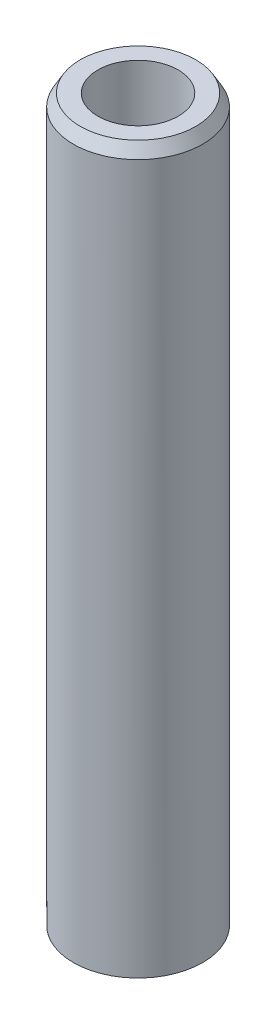
ISO-10303-21;
HEADER;
FILE_DESCRIPTION(('STEP AP214'),'2;1');
FILE_NAME('part.step','',(''),(''),'','','');
FILE_SCHEMA(('AUTOMOTIVE_DESIGN { 1 0 10303 214 1 1 1 1 }'));
ENDSEC;
DATA;
#1=APPLICATION_CONTEXT('core data for automotive mechanical design processes');
#2=APPLICATION_PROTOCOL_DEFINITION('international standard','automotive_design',2000,#1);
#3=PRODUCT_CONTEXT('',#1,'mechanical');
#4=PRODUCT('Part','Part','',(#3));
#5=PRODUCT_RELATED_PRODUCT_CATEGORY('part','',(#4));
#6=PRODUCT_DEFINITION_FORMATION('','',#4);
#7=PRODUCT_DEFINITION_CONTEXT('part definition',#1,'design');
#8=PRODUCT_DEFINITION('design','',#6,#7);
#9=PRODUCT_DEFINITION_SHAPE('','',#8);
#10=(LENGTH_UNIT() NAMED_UNIT(*) SI_UNIT(.MILLI.,.METRE.));
#11=(NAMED_UNIT(*) PLANE_ANGLE_UNIT() SI_UNIT($,.RADIAN.));
#12=(NAMED_UNIT(*) SI_UNIT($,.STERADIAN.) SOLID_ANGLE_UNIT());
#13=UNCERTAINTY_MEASURE_WITH_UNIT(LENGTH_MEASURE(1.E-05),#10,'distance_accuracy_value','');
#14=(GEOMETRIC_REPRESENTATION_CONTEXT(3) GLOBAL_UNCERTAINTY_ASSIGNED_CONTEXT((#13)) GLOBAL_UNIT_ASSIGNED_CONTEXT((#10,
#11,#12)) REPRESENTATION_CONTEXT('',''));
#15=CARTESIAN_POINT('',(0.,0.,0.));
#16=DIRECTION('',(0.,0.,1.));
#17=DIRECTION('',(1.,0.,0.));
#18=AXIS2_PLACEMENT_3D('',#15,#16,#17);
#19=CARTESIAN_POINT('',(0.,281.291442130686,0.));
#20=DIRECTION('',(0.,-1.,0.));
#21=DIRECTION('',(0.,0.,-1.));
#22=AXIS2_PLACEMENT_3D('',#19,#20,#21);
#23=CYLINDRICAL_SURFACE('',#22,25.);
#24=CARTESIAN_POINT('',(0.,276.663477284076,0.));
#25=DIRECTION('',(0.,1.,0.));
#26=DIRECTION('',(0.,0.,1.));
#27=AXIS2_PLACEMENT_3D('',#24,#25,#26);
#28=CIRCLE('',#27,25.);
#29=CARTESIAN_POINT('',(0.,276.663477284076,-25.));
#30=VERTEX_POINT('',#29);
#31=EDGE_CURVE('E50',#30,#30,#28,.F.);
#32=CARTESIAN_POINT('',(0.,2.67195674999049,0.));
#33=DIRECTION('',(0.,1.,0.));
#34=DIRECTION('',(0.,0.,1.));
#35=AXIS2_PLACEMENT_3D('',#32,#33,#34);
#36=CIRCLE('',#35,25.);
#37=CARTESIAN_POINT('',(0.,2.67195674999049,-25.));
#38=VERTEX_POINT('',#37);
#39=EDGE_CURVE('E51',#38,#38,#36,.T.);
#40=CARTESIAN_POINT('',(0.,276.663477284076,-25.));
#41=CARTESIAN_POINT('',(0.,273.809398945179,-25.));
#42=CARTESIAN_POINT('',(0.,270.955320606282,-25.));
#43=CARTESIAN_POINT('',(0.,265.247163928489,-25.));
#44=CARTESIAN_POINT('',(0.,262.393085589592,-25.));
#45=CARTESIAN_POINT('',(0.,256.684928911799,-25.));
#46=CARTESIAN_POINT('',(0.,253.830850572902,-25.));
#47=CARTESIAN_POINT('',(0.,248.122693895109,-25.));
#48=CARTESIAN_POINT('',(0.,245.268615556212,-25.));
#49=CARTESIAN_POINT('',(0.,239.560458878418,-25.));
#50=CARTESIAN_POINT('',(0.,236.706380539522,-25.));
#51=CARTESIAN_POINT('',(0.,230.998223861728,-25.));
#52=CARTESIAN_POINT('',(0.,228.144145522832,-25.));
#53=CARTESIAN_POINT('',(0.,222.435988845038,-25.));
#54=CARTESIAN_POINT('',(0.,219.581910506141,-25.));
#55=CARTESIAN_POINT('',(0.,213.873753828348,-25.));
#56=CARTESIAN_POINT('',(0.,211.019675489451,-25.));
#57=CARTESIAN_POINT('',(0.,205.311518811658,-25.));
#58=CARTESIAN_POINT('',(0.,202.457440472761,-25.));
#59=CARTESIAN_POINT('',(0.,196.749283794968,-25.));
#60=CARTESIAN_POINT('',(0.,193.895205456071,-25.));
#61=CARTESIAN_POINT('',(0.,188.187048778277,-25.));
#62=CARTESIAN_POINT('',(0.,185.332970439381,-25.));
#63=CARTESIAN_POINT('',(0.,179.624813761587,-25.));
#64=CARTESIAN_POINT('',(0.,176.770735422691,-25.));
#65=CARTESIAN_POINT('',(0.,171.062578744897,-25.));
#66=CARTESIAN_POINT('',(0.,168.208500406,-25.));
#67=CARTESIAN_POINT('',(0.,162.500343728207,-25.));
#68=CARTESIAN_POINT('',(0.,159.64626538931,-25.));
#69=CARTESIAN_POINT('',(0.,153.938108711517,-25.));
#70=CARTESIAN_POINT('',(0.,151.08403037262,-25.));
#71=CARTESIAN_POINT('',(0.,145.375873694827,-25.));
#72=CARTESIAN_POINT('',(0.,142.52179535593,-25.));
#73=CARTESIAN_POINT('',(0.,136.813638678136,-25.));
#74=CARTESIAN_POINT('',(0.,133.95956033924,-25.));
#75=CARTESIAN_POINT('',(0.,128.251403661446,-25.));
#76=CARTESIAN_POINT('',(0.,125.39732532255,-25.));
#77=CARTESIAN_POINT('',(0.,119.689168644756,-25.));
#78=CARTESIAN_POINT('',(0.,116.835090305859,-25.));
#79=CARTESIAN_POINT('',(0.,111.126933628066,-25.));
#80=CARTESIAN_POINT('',(0.,108.272855289169,-25.));
#81=CARTESIAN_POINT('',(0.,102.564698611376,-25.));
#82=CARTESIAN_POINT('',(0.,99.7106202724791,-25.));
#83=CARTESIAN_POINT('',(0.,94.0024635946856,-25.));
#84=CARTESIAN_POINT('',(0.,91.1483852557889,-25.));
#85=CARTESIAN_POINT('',(0.,85.4402285779955,-25.));
#86=CARTESIAN_POINT('',(0.,82.5861502390987,-25.));
#87=CARTESIAN_POINT('',(0.,76.8779935613053,-25.));
#88=CARTESIAN_POINT('',(0.,74.0239152224086,-25.));
#89=CARTESIAN_POINT('',(0.,68.3157585446151,-25.));
#90=CARTESIAN_POINT('',(0.,65.4616802057184,-25.));
#91=CARTESIAN_POINT('',(0.,59.753523527925,-25.));
#92=CARTESIAN_POINT('',(0.,56.8994451890282,-25.));
#93=CARTESIAN_POINT('',(0.,51.1912885112348,-25.));
#94=CARTESIAN_POINT('',(0.,48.3372101723381,-25.));
#95=CARTESIAN_POINT('',(0.,42.6290534945446,-25.));
#96=CARTESIAN_POINT('',(0.,39.7749751556479,-25.));
#97=CARTESIAN_POINT('',(0.,34.0668184778545,-25.));
#98=CARTESIAN_POINT('',(0.,31.2127401389577,-25.));
#99=CARTESIAN_POINT('',(0.,25.5045834611643,-25.));
#100=CARTESIAN_POINT('',(0.,22.6505051222676,-25.));
#101=CARTESIAN_POINT('',(0.,16.9423484444741,-25.));
#102=CARTESIAN_POINT('',(0.,14.0882701055774,-25.));
#103=CARTESIAN_POINT('',(0.,8.38011342778394,-25.));
#104=CARTESIAN_POINT('',(0.,5.52603508888722,-25.));
#105=CARTESIAN_POINT('',(0.,2.67195674999049,-25.));
#106=B_SPLINE_CURVE_WITH_KNOTS('',3,(#40,#41,#42,#43,#44,#45,#46,#47,#48,#49,#50,#51,#52,#53,
#54,#55,#56,#57,#58,#59,#60,#61,#62,#63,#64,#65,#66,#67,#68,#69,#70,#71,#72,#73,#74,#75,#76,#77,
#78,#79,#80,#81,#82,#83,#84,#85,#86,#87,#88,#89,#90,#91,#92,#93,#94,#95,#96,#97,#98,#99,#100,
#101,#102,#103,#104,#105),.UNSPECIFIED.,.F.,.F.,(4,2,2,2,2,2,2,2,2,2,2,2,2,2,2,2,2,2,2,2,2,2,2,
2,2,2,2,2,2,2,2,2,4),(0.,8.56223501669012,17.1244700333803,25.6867050500705,34.2489400667607,
42.8111750834508,51.373410100141,59.9356451168311,68.4978801335213,77.0601151502115,
85.6223501669017,94.1845851835918,102.746820200282,111.309055216972,119.871290233662,
128.433525250352,136.995760267043,145.557995283733,154.120230300423,162.682465317113,
171.244700333803,179.806935350493,188.369170367184,196.931405383874,205.493640400564,
214.055875417254,222.618110433944,231.180345450635,239.742580467325,248.304815484015,
256.867050500705,265.429285517395,273.991520534085),.UNSPECIFIED.);
#107=EDGE_CURVE('BSEAM39',#30,#38,#106,.T.);
#108=ORIENTED_EDGE('',*,*,#31,.T.);
#109=ORIENTED_EDGE('',*,*,#39,.T.);
#110=ORIENTED_EDGE('',*,*,#107,.T.);
#111=ORIENTED_EDGE('',*,*,#107,.F.);
#112=EDGE_LOOP('',(#108,#110,#109,#111));
#113=FACE_BOUND('',#112,.T.);
#114=ADVANCED_FACE('F39',(#113),#23,.T.);
#115=CARTESIAN_POINT('',(0.,281.291442130686,0.));
#116=DIRECTION('',(0.,1.,0.));
#117=DIRECTION('',(0.,0.,1.));
#118=AXIS2_PLACEMENT_3D('',#115,#116,#117);
#119=PLANE('',#118);
#120=CARTESIAN_POINT('',(0.,281.291442130686,0.));
#121=DIRECTION('',(0.,1.,0.));
#122=DIRECTION('',(0.,0.,1.));
#123=AXIS2_PLACEMENT_3D('',#120,#121,#122);
#124=CIRCLE('',#123,22.3280432500098);
#125=CARTESIAN_POINT('',(0.,281.291442130686,22.3280432500098));
#126=VERTEX_POINT('',#125);
#127=EDGE_CURVE('E54',#126,#126,#124,.T.);
#128=ORIENTED_EDGE('',*,*,#127,.T.);
#129=EDGE_LOOP('',(#128));
#130=FACE_BOUND('',#129,.T.);
#131=CARTESIAN_POINT('',(0.,281.291442130686,0.));
#132=DIRECTION('',(0.,1.,0.));
#133=DIRECTION('',(0.,0.,1.));
#134=AXIS2_PLACEMENT_3D('',#131,#132,#133);
#135=CIRCLE('',#134,15.5245014884479);
#136=CARTESIAN_POINT('',(0.,281.291442130686,-15.5245014884479));
#137=VERTEX_POINT('',#136);
#138=EDGE_CURVE('E58',#137,#137,#135,.T.);
#139=ORIENTED_EDGE('',*,*,#138,.F.);
#140=EDGE_LOOP('',(#139));
#141=FACE_BOUND('',#140,.T.);
#142=ADVANCED_FACE('F69',(#130,#141),#119,.T.);
#143=CARTESIAN_POINT('',(0.,0.,0.));
#144=DIRECTION('',(0.,1.,0.));
#145=DIRECTION('',(0.,0.,1.));
#146=AXIS2_PLACEMENT_3D('',#143,#144,#145);
#147=PLANE('',#146);
#148=CARTESIAN_POINT('',(0.,0.,0.));
#149=DIRECTION('',(0.,1.,0.));
#150=DIRECTION('',(0.,0.,1.));
#151=AXIS2_PLACEMENT_3D('',#148,#149,#150);
#152=CIRCLE('',#151,20.3720351533898);
#153=CARTESIAN_POINT('',(0.,0.,20.3720351533898));
#154=VERTEX_POINT('',#153);
#155=EDGE_CURVE('E10',#154,#154,#152,.F.);
#156=ORIENTED_EDGE('',*,*,#155,.T.);
#157=EDGE_LOOP('',(#156));
#158=FACE_BOUND('',#157,.T.);
#159=CARTESIAN_POINT('',(0.,0.,0.));
#160=DIRECTION('',(0.,1.,0.));
#161=DIRECTION('',(0.,0.,1.));
#162=AXIS2_PLACEMENT_3D('',#159,#160,#161);
#163=CIRCLE('',#162,15.5245014884479);
#164=CARTESIAN_POINT('',(0.,0.,-15.5245014884479));
#165=VERTEX_POINT('',#164);
#166=EDGE_CURVE('E63',#165,#165,#163,.T.);
#167=ORIENTED_EDGE('',*,*,#166,.T.);
#168=EDGE_LOOP('',(#167));
#169=FACE_BOUND('',#168,.T.);
#170=ADVANCED_FACE('F75',(#158,#169),#147,.F.);
#171=CARTESIAN_POINT('',(0.,281.291442130686,0.));
#172=DIRECTION('',(0.,-1.,0.));
#173=DIRECTION('',(0.,0.,-1.));
#174=AXIS2_PLACEMENT_3D('',#171,#172,#173);
#175=CYLINDRICAL_SURFACE('',#174,15.5245014884479);
#176=CARTESIAN_POINT('',(0.,281.291442130686,-15.5245014884479));
#177=CARTESIAN_POINT('',(0.,278.361322941824,-15.5245014884479));
#178=CARTESIAN_POINT('',(0.,275.431203752963,-15.5245014884479));
#179=CARTESIAN_POINT('',(0.,269.57096537524,-15.5245014884479));
#180=CARTESIAN_POINT('',(0.,266.640846186379,-15.5245014884479));
#181=CARTESIAN_POINT('',(0.,260.780607808656,-15.5245014884479));
#182=CARTESIAN_POINT('',(0.,257.850488619795,-15.5245014884479));
#183=CARTESIAN_POINT('',(0.,251.990250242072,-15.5245014884479));
#184=CARTESIAN_POINT('',(0.,249.060131053211,-15.5245014884479));
#185=CARTESIAN_POINT('',(0.,243.199892675489,-15.5245014884479));
#186=CARTESIAN_POINT('',(0.,240.269773486627,-15.5245014884479));
#187=CARTESIAN_POINT('',(0.,234.409535108905,-15.5245014884479));
#188=CARTESIAN_POINT('',(0.,231.479415920043,-15.5245014884479));
#189=CARTESIAN_POINT('',(0.,225.619177542321,-15.5245014884479));
#190=CARTESIAN_POINT('',(0.,222.689058353459,-15.5245014884479));
#191=CARTESIAN_POINT('',(0.,216.828819975737,-15.5245014884479));
#192=CARTESIAN_POINT('',(0.,213.898700786875,-15.5245014884479));
#193=CARTESIAN_POINT('',(0.,208.038462409153,-15.5245014884479));
#194=CARTESIAN_POINT('',(0.,205.108343220292,-15.5245014884479));
#195=CARTESIAN_POINT('',(0.,199.248104842569,-15.5245014884479));
#196=CARTESIAN_POINT('',(0.,196.317985653708,-15.5245014884479));
#197=CARTESIAN_POINT('',(0.,190.457747275985,-15.5245014884479));
#198=CARTESIAN_POINT('',(0.,187.527628087124,-15.5245014884479));
#199=CARTESIAN_POINT('',(0.,181.667389709401,-15.5245014884479));
#200=CARTESIAN_POINT('',(0.,178.73727052054,-15.5245014884479));
#201=CARTESIAN_POINT('',(0.,172.877032142817,-15.5245014884479));
#202=CARTESIAN_POINT('',(0.,169.946912953956,-15.5245014884479));
#203=CARTESIAN_POINT('',(0.,164.086674576233,-15.5245014884479));
#204=CARTESIAN_POINT('',(0.,161.156555387372,-15.5245014884479));
#205=CARTESIAN_POINT('',(0.,155.296317009649,-15.5245014884479));
#206=CARTESIAN_POINT('',(0.,152.366197820788,-15.5245014884479));
#207=CARTESIAN_POINT('',(0.,146.505959443065,-15.5245014884479));
#208=CARTESIAN_POINT('',(0.,143.575840254204,-15.5245014884479));
#209=CARTESIAN_POINT('',(0.,137.715601876481,-15.5245014884479));
#210=CARTESIAN_POINT('',(0.,134.78548268762,-15.5245014884479));
#211=CARTESIAN_POINT('',(0.,128.925244309898,-15.5245014884479));
#212=CARTESIAN_POINT('',(0.,125.995125121036,-15.5245014884479));
#213=CARTESIAN_POINT('',(0.,120.134886743314,-15.5245014884479));
#214=CARTESIAN_POINT('',(0.,117.204767554452,-15.5245014884479));
#215=CARTESIAN_POINT('',(0.,111.34452917673,-15.5245014884479));
#216=CARTESIAN_POINT('',(0.,108.414409987868,-15.5245014884479));
#217=CARTESIAN_POINT('',(0.,102.554171610146,-15.5245014884479));
#218=CARTESIAN_POINT('',(0.,99.6240524212844,-15.5245014884479));
#219=CARTESIAN_POINT('',(0.,93.7638140435618,-15.5245014884479));
#220=CARTESIAN_POINT('',(0.,90.8336948547005,-15.5245014884479));
#221=CARTESIAN_POINT('',(0.,84.9734564769779,-15.5245014884479));
#222=CARTESIAN_POINT('',(0.,82.0433372881166,-15.5245014884479));
#223=CARTESIAN_POINT('',(0.,76.183098910394,-15.5245014884479));
#224=CARTESIAN_POINT('',(0.,73.2529797215327,-15.5245014884479));
#225=CARTESIAN_POINT('',(0.,67.39274134381,-15.5245014884479));
#226=CARTESIAN_POINT('',(0.,64.4626221549487,-15.5245014884479));
#227=CARTESIAN_POINT('',(0.,58.6023837772261,-15.5245014884479));
#228=CARTESIAN_POINT('',(0.,55.6722645883648,-15.5245014884479));
#229=CARTESIAN_POINT('',(0.,49.8120262106422,-15.5245014884479));
#230=CARTESIAN_POINT('',(0.,46.8819070217809,-15.5245014884479));
#231=CARTESIAN_POINT('',(0.,41.0216686440583,-15.5245014884479));
#232=CARTESIAN_POINT('',(0.,38.091549455197,-15.5245014884479));
#233=CARTESIAN_POINT('',(0.,32.2313110774743,-15.5245014884479));
#234=CARTESIAN_POINT('',(0.,29.301191888613,-15.5245014884479));
#235=CARTESIAN_POINT('',(0.,23.4409535108904,-15.5245014884479));
#236=CARTESIAN_POINT('',(0.,20.5108343220291,-15.5245014884479));
#237=CARTESIAN_POINT('',(0.,14.6505959443065,-15.5245014884479));
#238=CARTESIAN_POINT('',(0.,11.7204767554452,-15.5245014884479));
#239=CARTESIAN_POINT('',(0.,5.86023837772256,-15.5245014884479));
#240=CARTESIAN_POINT('',(0.,2.93011918886125,-15.5245014884479));
#241=CARTESIAN_POINT('',(0.,0.,-15.5245014884479));
#242=B_SPLINE_CURVE_WITH_KNOTS('',3,(#176,#177,#178,#179,#180,#181,#182,#183,#184,#185,#186,
#187,#188,#189,#190,#191,#192,#193,#194,#195,#196,#197,#198,#199,#200,#201,#202,#203,#204,#205,
#206,#207,#208,#209,#210,#211,#212,#213,#214,#215,#216,#217,#218,#219,#220,#221,#222,#223,#224,
#225,#226,#227,#228,#229,#230,#231,#232,#233,#234,#235,#236,#237,#238,#239,#240,#241),
.UNSPECIFIED.,.F.,.F.,(4,2,2,2,2,2,2,2,2,2,2,2,2,2,2,2,2,2,2,2,2,2,2,2,2,2,2,2,2,2,2,2,4),(0.,
8.79035756658392,17.5807151331678,26.3710726997518,35.1614302663357,43.9517878329196,
52.7421453995035,61.5325029660874,70.3228605326714,79.1132180992553,87.9035756658392,
96.6939332324231,105.484290799007,114.274648365591,123.065005932175,131.855363498759,
140.645721065343,149.436078631927,158.226436198511,167.016793765095,175.807151331678,
184.597508898262,193.387866464846,202.17822403143,210.968581598014,219.758939164598,
228.549296731182,237.339654297766,246.13001186435,254.920369430934,263.710726997518,
272.501084564102,281.291442130686),.UNSPECIFIED.);
#243=EDGE_CURVE('BSEAM70',#137,#165,#242,.T.);
#244=ORIENTED_EDGE('',*,*,#138,.T.);
#245=ORIENTED_EDGE('',*,*,#166,.F.);
#246=ORIENTED_EDGE('',*,*,#243,.T.);
#247=ORIENTED_EDGE('',*,*,#243,.F.);
#248=EDGE_LOOP('',(#244,#246,#245,#247));
#249=FACE_BOUND('',#248,.T.);
#250=ADVANCED_FACE('F70',(#249),#175,.F.);
#251=CARTESIAN_POINT('',(0.,281.291442130686,0.));
#252=DIRECTION('',(0.,-1.,0.));
#253=DIRECTION('',(0.,0.,-1.));
#254=AXIS2_PLACEMENT_3D('',#251,#252,#253);
#255=CONICAL_SURFACE('',#254,22.3280432500098,0.523598775598292);
#256=ORIENTED_EDGE('',*,*,#31,.F.);
#257=EDGE_LOOP('',(#256));
#258=FACE_BOUND('',#257,.T.);
#259=ORIENTED_EDGE('',*,*,#127,.F.);
#260=EDGE_LOOP('',(#259));
#261=FACE_BOUND('',#260,.T.);
#262=ADVANCED_FACE('F81',(#258,#261),#255,.T.);
#263=CARTESIAN_POINT('',(0.,2.67195674999049,0.));
#264=DIRECTION('',(0.,1.,0.));
#265=DIRECTION('',(0.,0.,1.));
#266=AXIS2_PLACEMENT_3D('',#263,#264,#265);
#267=CONICAL_SURFACE('',#266,25.,1.0471975511966);
#268=ORIENTED_EDGE('',*,*,#155,.F.);
#269=EDGE_LOOP('',(#268));
#270=FACE_BOUND('',#269,.T.);
#271=ORIENTED_EDGE('',*,*,#39,.F.);
#272=EDGE_LOOP('',(#271));
#273=FACE_BOUND('',#272,.T.);
#274=ADVANCED_FACE('F45',(#270,#273),#267,.T.);
#275=CLOSED_SHELL('',(#114,#142,#170,#250,#262,#274));
#276=MANIFOLD_SOLID_BREP('B2',#275);
#277=ADVANCED_BREP_SHAPE_REPRESENTATION('',(#18,#276),#14);
#278=SHAPE_DEFINITION_REPRESENTATION(#9,#277);
ENDSEC;
END-ISO-10303-21;
